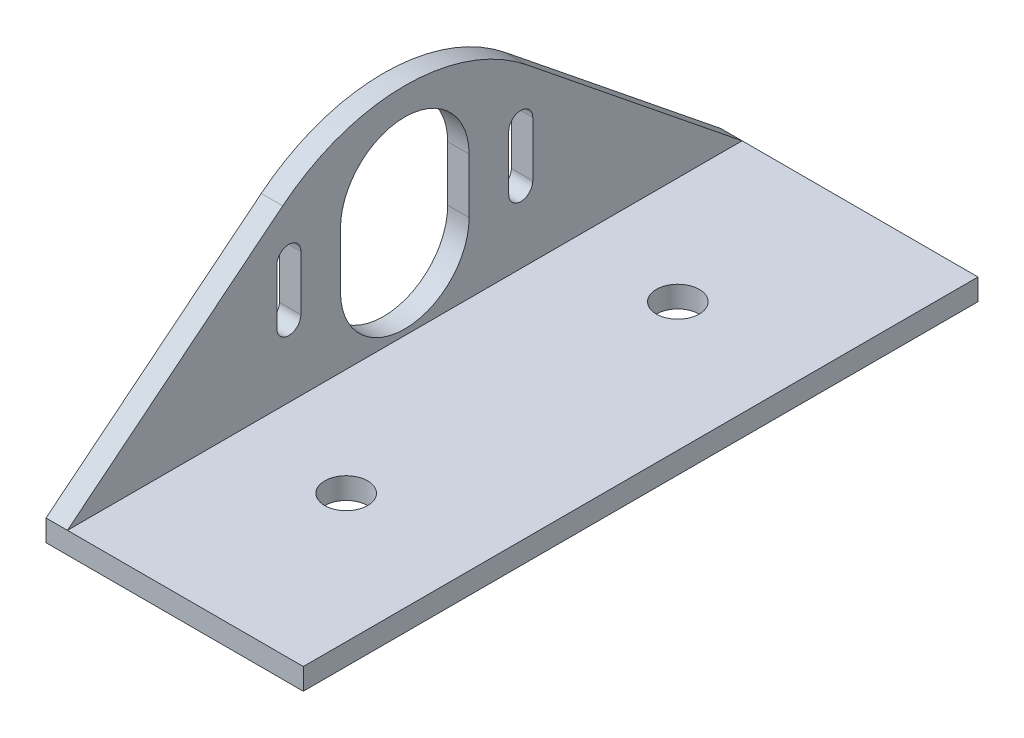
ISO-10303-21;
HEADER;
FILE_DESCRIPTION(('STEP AP214'),'2;1');
FILE_NAME('part.step','',(''),(''),'','','');
FILE_SCHEMA(('AUTOMOTIVE_DESIGN { 1 0 10303 214 1 1 1 1 }'));
ENDSEC;
DATA;
#1=APPLICATION_CONTEXT('core data for automotive mechanical design processes');
#2=APPLICATION_PROTOCOL_DEFINITION('international standard','automotive_design',2000,#1);
#3=PRODUCT_CONTEXT('',#1,'mechanical');
#4=PRODUCT('Part','Part','',(#3));
#5=PRODUCT_RELATED_PRODUCT_CATEGORY('part','',(#4));
#6=PRODUCT_DEFINITION_FORMATION('','',#4);
#7=PRODUCT_DEFINITION_CONTEXT('part definition',#1,'design');
#8=PRODUCT_DEFINITION('design','',#6,#7);
#9=PRODUCT_DEFINITION_SHAPE('','',#8);
#10=(LENGTH_UNIT() NAMED_UNIT(*) SI_UNIT(.MILLI.,.METRE.));
#11=(NAMED_UNIT(*) PLANE_ANGLE_UNIT() SI_UNIT($,.RADIAN.));
#12=(NAMED_UNIT(*) SI_UNIT($,.STERADIAN.) SOLID_ANGLE_UNIT());
#13=UNCERTAINTY_MEASURE_WITH_UNIT(LENGTH_MEASURE(1.E-05),#10,'distance_accuracy_value','');
#14=(GEOMETRIC_REPRESENTATION_CONTEXT(3) GLOBAL_UNCERTAINTY_ASSIGNED_CONTEXT((#13)) GLOBAL_UNIT_ASSIGNED_CONTEXT((#10,
#11,#12)) REPRESENTATION_CONTEXT('',''));
#15=CARTESIAN_POINT('',(0.,0.,0.));
#16=DIRECTION('',(0.,0.,1.));
#17=DIRECTION('',(1.,0.,0.));
#18=AXIS2_PLACEMENT_3D('',#15,#16,#17);
#19=CARTESIAN_POINT('',(0.,3.175,0.));
#20=DIRECTION('',(0.,1.,0.));
#21=DIRECTION('',(0.,0.,1.));
#22=AXIS2_PLACEMENT_3D('',#19,#20,#21);
#23=PLANE('',#22);
#24=DIRECTION('',(0.,0.,1.));
#25=VECTOR('',#24,1.);
#26=CARTESIAN_POINT('',(19.05,3.175,172.72));
#27=LINE('',#26,#25);
#28=CARTESIAN_POINT('',(19.05,3.175,72.8133333333333));
#29=VERTEX_POINT('',#28);
#30=CARTESIAN_POINT('',(19.05,3.175,172.72));
#31=VERTEX_POINT('',#30);
#32=EDGE_CURVE('E266',#29,#31,#27,.T.);
#33=ORIENTED_EDGE('',*,*,#32,.F.);
#34=DIRECTION('',(-1.,0.,0.));
#35=VECTOR('',#34,1.);
#36=CARTESIAN_POINT('',(-15.875,3.175,72.8133333333333));
#37=LINE('',#36,#35);
#38=CARTESIAN_POINT('',(-15.875,3.175,72.8133333333333));
#39=VERTEX_POINT('',#38);
#40=EDGE_CURVE('E311',#29,#39,#37,.T.);
#41=ORIENTED_EDGE('',*,*,#40,.T.);
#42=DIRECTION('',(0.,0.,-1.));
#43=VECTOR('',#42,1.);
#44=CARTESIAN_POINT('',(-15.875,3.175,63.5));
#45=LINE('',#44,#43);
#46=CARTESIAN_POINT('',(-15.875,3.175,172.72));
#47=VERTEX_POINT('',#46);
#48=EDGE_CURVE('E314',#47,#39,#45,.T.);
#49=ORIENTED_EDGE('',*,*,#48,.F.);
#50=DIRECTION('',(-1.,0.,0.));
#51=VECTOR('',#50,1.);
#52=CARTESIAN_POINT('',(38.1,3.175,172.72));
#53=LINE('',#52,#51);
#54=EDGE_CURVE('E12',#31,#47,#53,.T.);
#55=ORIENTED_EDGE('',*,*,#54,.F.);
#56=EDGE_LOOP('',(#33,#41,#49,#55));
#57=FACE_BOUND('',#56,.T.);
#58=CARTESIAN_POINT('',(0.,3.175,98.2133333333333));
#59=DIRECTION('',(0.,1.,0.));
#60=DIRECTION('',(0.,0.,1.));
#61=AXIS2_PLACEMENT_3D('',#58,#59,#60);
#62=CIRCLE('',#61,3.17499999999999);
#63=CARTESIAN_POINT('',(0.,3.175,101.388333333333));
#64=VERTEX_POINT('',#63);
#65=EDGE_CURVE('E322',#64,#64,#62,.T.);
#66=ORIENTED_EDGE('',*,*,#65,.F.);
#67=EDGE_LOOP('',(#66));
#68=FACE_BOUND('',#67,.T.);
#69=CARTESIAN_POINT('',(0.,3.175,147.32));
#70=DIRECTION('',(0.,1.,0.));
#71=DIRECTION('',(0.,0.,1.));
#72=AXIS2_PLACEMENT_3D('',#69,#70,#71);
#73=CIRCLE('',#72,3.175);
#74=CARTESIAN_POINT('',(0.,3.175,150.495));
#75=VERTEX_POINT('',#74);
#76=EDGE_CURVE('E318',#75,#75,#73,.T.);
#77=ORIENTED_EDGE('',*,*,#76,.F.);
#78=EDGE_LOOP('',(#77));
#79=FACE_BOUND('',#78,.T.);
#80=ADVANCED_FACE('F34',(#57,#68,#79),#23,.T.);
#81=CARTESIAN_POINT('',(0.,0.,0.));
#82=DIRECTION('',(0.,1.,0.));
#83=DIRECTION('',(0.,0.,1.));
#84=AXIS2_PLACEMENT_3D('',#81,#82,#83);
#85=PLANE('',#84);
#86=CARTESIAN_POINT('',(0.,0.,147.32));
#87=DIRECTION('',(0.,1.,0.));
#88=DIRECTION('',(0.,0.,1.));
#89=AXIS2_PLACEMENT_3D('',#86,#87,#88);
#90=CIRCLE('',#89,3.175);
#91=CARTESIAN_POINT('',(0.,0.,150.495));
#92=VERTEX_POINT('',#91);
#93=EDGE_CURVE('E325',#92,#92,#90,.T.);
#94=ORIENTED_EDGE('',*,*,#93,.T.);
#95=EDGE_LOOP('',(#94));
#96=FACE_BOUND('',#95,.T.);
#97=CARTESIAN_POINT('',(0.,0.,98.2133333333333));
#98=DIRECTION('',(0.,1.,0.));
#99=DIRECTION('',(0.,0.,1.));
#100=AXIS2_PLACEMENT_3D('',#97,#98,#99);
#101=CIRCLE('',#100,3.17499999999999);
#102=CARTESIAN_POINT('',(0.,0.,101.388333333333));
#103=VERTEX_POINT('',#102);
#104=EDGE_CURVE('E319',#103,#103,#101,.T.);
#105=ORIENTED_EDGE('',*,*,#104,.T.);
#106=EDGE_LOOP('',(#105));
#107=FACE_BOUND('',#106,.T.);
#108=DIRECTION('',(-1.,0.,0.));
#109=VECTOR('',#108,1.);
#110=CARTESIAN_POINT('',(-15.875,0.,72.8133333333333));
#111=LINE('',#110,#109);
#112=CARTESIAN_POINT('',(19.05,0.,72.8133333333333));
#113=VERTEX_POINT('',#112);
#114=CARTESIAN_POINT('',(-19.05,0.,72.8133333333333));
#115=VERTEX_POINT('',#114);
#116=EDGE_CURVE('E312',#113,#115,#111,.T.);
#117=ORIENTED_EDGE('',*,*,#116,.F.);
#118=DIRECTION('',(0.,0.,1.));
#119=VECTOR('',#118,1.);
#120=CARTESIAN_POINT('',(19.05,0.,172.72));
#121=LINE('',#120,#119);
#122=CARTESIAN_POINT('',(19.05,0.,172.72));
#123=VERTEX_POINT('',#122);
#124=EDGE_CURVE('E267',#113,#123,#121,.T.);
#125=ORIENTED_EDGE('',*,*,#124,.T.);
#126=DIRECTION('',(1.,0.,0.));
#127=VECTOR('',#126,1.);
#128=CARTESIAN_POINT('',(38.1,0.,172.72));
#129=LINE('',#128,#127);
#130=CARTESIAN_POINT('',(-19.05,0.,172.72));
#131=VERTEX_POINT('',#130);
#132=EDGE_CURVE('E42',#131,#123,#129,.T.);
#133=ORIENTED_EDGE('',*,*,#132,.F.);
#134=DIRECTION('',(0.,0.,-1.));
#135=VECTOR('',#134,1.);
#136=CARTESIAN_POINT('',(-19.05,0.,172.72));
#137=LINE('',#136,#135);
#138=EDGE_CURVE('E291',#131,#115,#137,.T.);
#139=ORIENTED_EDGE('',*,*,#138,.T.);
#140=EDGE_LOOP('',(#117,#125,#133,#139));
#141=FACE_BOUND('',#140,.T.);
#142=ADVANCED_FACE('F36',(#96,#107,#141),#85,.F.);
#143=CARTESIAN_POINT('',(0.,0.,172.72));
#144=DIRECTION('',(0.,0.,-1.));
#145=DIRECTION('',(-1.,0.,0.));
#146=AXIS2_PLACEMENT_3D('',#143,#144,#145);
#147=PLANE('',#146);
#148=ORIENTED_EDGE('',*,*,#132,.T.);
#149=DIRECTION('',(0.,1.,0.));
#150=VECTOR('',#149,1.);
#151=CARTESIAN_POINT('',(19.05,0.,172.72));
#152=LINE('',#151,#150);
#153=EDGE_CURVE('E272',#123,#31,#152,.T.);
#154=ORIENTED_EDGE('',*,*,#153,.T.);
#155=ORIENTED_EDGE('',*,*,#54,.T.);
#156=DIRECTION('',(1.,0.,0.));
#157=VECTOR('',#156,1.);
#158=CARTESIAN_POINT('',(-19.05,3.175,172.72));
#159=LINE('',#158,#157);
#160=CARTESIAN_POINT('',(-19.05,3.175,172.72));
#161=VERTEX_POINT('',#160);
#162=EDGE_CURVE('E308',#161,#47,#159,.T.);
#163=ORIENTED_EDGE('',*,*,#162,.F.);
#164=DIRECTION('',(0.,1.,0.));
#165=VECTOR('',#164,1.);
#166=CARTESIAN_POINT('',(-19.05,0.,172.72));
#167=LINE('',#166,#165);
#168=EDGE_CURVE('E277',#131,#161,#167,.T.);
#169=ORIENTED_EDGE('',*,*,#168,.F.);
#170=EDGE_LOOP('',(#148,#154,#155,#163,#169));
#171=FACE_BOUND('',#170,.T.);
#172=ADVANCED_FACE('F332',(#171),#147,.F.);
#173=CARTESIAN_POINT('',(0.,0.,147.32));
#174=DIRECTION('',(0.,1.,0.));
#175=DIRECTION('',(0.,0.,1.));
#176=AXIS2_PLACEMENT_3D('',#173,#174,#175);
#177=CYLINDRICAL_SURFACE('',#176,3.175);
#178=ORIENTED_EDGE('',*,*,#93,.F.);
#179=EDGE_LOOP('',(#178));
#180=FACE_BOUND('',#179,.T.);
#181=ORIENTED_EDGE('',*,*,#76,.T.);
#182=EDGE_LOOP('',(#181));
#183=FACE_BOUND('',#182,.T.);
#184=ADVANCED_FACE('F381',(#180,#183),#177,.F.);
#185=CARTESIAN_POINT('',(0.,0.,98.2133333333333));
#186=DIRECTION('',(0.,1.,0.));
#187=DIRECTION('',(0.,0.,1.));
#188=AXIS2_PLACEMENT_3D('',#185,#186,#187);
#189=CYLINDRICAL_SURFACE('',#188,3.17499999999999);
#190=ORIENTED_EDGE('',*,*,#104,.F.);
#191=EDGE_LOOP('',(#190));
#192=FACE_BOUND('',#191,.T.);
#193=ORIENTED_EDGE('',*,*,#65,.T.);
#194=EDGE_LOOP('',(#193));
#195=FACE_BOUND('',#194,.T.);
#196=ADVANCED_FACE('F384',(#192,#195),#189,.F.);
#197=CARTESIAN_POINT('',(-15.875,0.,72.8133333333333));
#198=DIRECTION('',(0.,0.,-1.));
#199=DIRECTION('',(-1.,0.,0.));
#200=AXIS2_PLACEMENT_3D('',#197,#198,#199);
#201=PLANE('',#200);
#202=DIRECTION('',(0.,1.,0.));
#203=VECTOR('',#202,1.);
#204=CARTESIAN_POINT('',(19.05,0.,72.8133333333333));
#205=LINE('',#204,#203);
#206=EDGE_CURVE('E270',#113,#29,#205,.T.);
#207=ORIENTED_EDGE('',*,*,#206,.F.);
#208=ORIENTED_EDGE('',*,*,#116,.T.);
#209=DIRECTION('',(0.,1.,0.));
#210=VECTOR('',#209,1.);
#211=CARTESIAN_POINT('',(-19.05,0.,72.8133333333333));
#212=LINE('',#211,#210);
#213=CARTESIAN_POINT('',(-19.05,3.175,72.8133333333333));
#214=VERTEX_POINT('',#213);
#215=EDGE_CURVE('E288',#115,#214,#212,.T.);
#216=ORIENTED_EDGE('',*,*,#215,.T.);
#217=DIRECTION('',(1.,0.,0.));
#218=VECTOR('',#217,1.);
#219=CARTESIAN_POINT('',(-19.05,3.175,72.8133333333333));
#220=LINE('',#219,#218);
#221=EDGE_CURVE('E294',#214,#39,#220,.T.);
#222=ORIENTED_EDGE('',*,*,#221,.T.);
#223=ORIENTED_EDGE('',*,*,#40,.F.);
#224=EDGE_LOOP('',(#207,#208,#216,#222,#223));
#225=FACE_BOUND('',#224,.T.);
#226=ADVANCED_FACE('F344',(#225),#201,.T.);
#227=CARTESIAN_POINT('',(-15.875,6.40446834382458,122.766666666667));
#228=DIRECTION('',(-1.,0.,0.));
#229=DIRECTION('',(0.,0.,1.));
#230=AXIS2_PLACEMENT_3D('',#227,#228,#229);
#231=PLANE('',#230);
#232=DIRECTION('',(0.,1.,0.));
#233=VECTOR('',#232,1.);
#234=CARTESIAN_POINT('',(-15.875,6.40446834382458,141.716389559935));
#235=LINE('',#234,#233);
#236=CARTESIAN_POINT('',(-15.875,13.5459562161051,141.716389559935));
#237=VERTEX_POINT('',#236);
#238=CARTESIAN_POINT('',(-15.875,21.6805168486304,141.716389559935));
#239=VERTEX_POINT('',#238);
#240=EDGE_CURVE('E228',#237,#239,#235,.T.);
#241=ORIENTED_EDGE('',*,*,#240,.T.);
#242=CARTESIAN_POINT('',(-15.875,21.6805168486304,139.938389559935));
#243=DIRECTION('',(-1.,0.,0.));
#244=DIRECTION('',(0.,0.,1.));
#245=AXIS2_PLACEMENT_3D('',#242,#243,#244);
#246=CIRCLE('',#245,1.778);
#247=CARTESIAN_POINT('',(-15.875,21.6805168486304,138.160389559935));
#248=VERTEX_POINT('',#247);
#249=EDGE_CURVE('E231',#239,#248,#246,.T.);
#250=ORIENTED_EDGE('',*,*,#249,.T.);
#251=DIRECTION('',(0.,-1.,0.));
#252=VECTOR('',#251,1.);
#253=CARTESIAN_POINT('',(-15.875,6.40446834382458,138.160389559935));
#254=LINE('',#253,#252);
#255=CARTESIAN_POINT('',(-15.875,13.5459562161051,138.160389559935));
#256=VERTEX_POINT('',#255);
#257=EDGE_CURVE('E225',#248,#256,#254,.T.);
#258=ORIENTED_EDGE('',*,*,#257,.T.);
#259=CARTESIAN_POINT('',(-15.875,13.5459562161051,139.938389559935));
#260=DIRECTION('',(-1.,0.,0.));
#261=DIRECTION('',(0.,0.,1.));
#262=AXIS2_PLACEMENT_3D('',#259,#260,#261);
#263=CIRCLE('',#262,1.778);
#264=EDGE_CURVE('E169',#256,#237,#263,.T.);
#265=ORIENTED_EDGE('',*,*,#264,.T.);
#266=EDGE_LOOP('',(#241,#250,#258,#265));
#267=FACE_BOUND('',#266,.T.);
#268=DIRECTION('',(0.,1.,0.));
#269=VECTOR('',#268,1.);
#270=CARTESIAN_POINT('',(-15.875,6.40446834382458,107.372943773399));
#271=LINE('',#270,#269);
#272=CARTESIAN_POINT('',(-15.875,13.5459562161051,107.372943773399));
#273=VERTEX_POINT('',#272);
#274=CARTESIAN_POINT('',(-15.875,21.6805168486304,107.372943773399));
#275=VERTEX_POINT('',#274);
#276=EDGE_CURVE('E219',#273,#275,#271,.T.);
#277=ORIENTED_EDGE('',*,*,#276,.T.);
#278=CARTESIAN_POINT('',(-15.875,21.6805168486304,105.594943773399));
#279=DIRECTION('',(-1.,0.,0.));
#280=DIRECTION('',(0.,0.,1.));
#281=AXIS2_PLACEMENT_3D('',#278,#279,#280);
#282=CIRCLE('',#281,1.778);
#283=CARTESIAN_POINT('',(-15.875,21.6805168486304,103.816943773399));
#284=VERTEX_POINT('',#283);
#285=EDGE_CURVE('E222',#275,#284,#282,.T.);
#286=ORIENTED_EDGE('',*,*,#285,.T.);
#287=DIRECTION('',(0.,-1.,0.));
#288=VECTOR('',#287,1.);
#289=CARTESIAN_POINT('',(-15.875,6.40446834382452,103.816943773399));
#290=LINE('',#289,#288);
#291=CARTESIAN_POINT('',(-15.875,13.5459562161051,103.816943773399));
#292=VERTEX_POINT('',#291);
#293=EDGE_CURVE('E193',#284,#292,#290,.T.);
#294=ORIENTED_EDGE('',*,*,#293,.T.);
#295=CARTESIAN_POINT('',(-15.875,13.5459562161051,105.594943773399));
#296=DIRECTION('',(-1.,0.,0.));
#297=DIRECTION('',(0.,0.,1.));
#298=AXIS2_PLACEMENT_3D('',#295,#296,#297);
#299=CIRCLE('',#298,1.77799999999999);
#300=EDGE_CURVE('E216',#292,#273,#299,.T.);
#301=ORIENTED_EDGE('',*,*,#300,.T.);
#302=EDGE_LOOP('',(#277,#286,#294,#301));
#303=FACE_BOUND('',#302,.T.);
#304=DIRECTION('',(0.,1.,0.));
#305=VECTOR('',#304,1.);
#306=CARTESIAN_POINT('',(-15.875,6.40446834382458,132.291666666667));
#307=LINE('',#306,#305);
#308=CARTESIAN_POINT('',(-15.875,13.5459562161051,132.291666666667));
#309=VERTEX_POINT('',#308);
#310=CARTESIAN_POINT('',(-15.875,21.6805168486304,132.291666666667));
#311=VERTEX_POINT('',#310);
#312=EDGE_CURVE('E260',#309,#311,#307,.T.);
#313=ORIENTED_EDGE('',*,*,#312,.T.);
#314=CARTESIAN_POINT('',(-15.875,21.6805168486304,122.766666666667));
#315=DIRECTION('',(-1.,0.,0.));
#316=DIRECTION('',(0.,0.,1.));
#317=AXIS2_PLACEMENT_3D('',#314,#315,#316);
#318=CIRCLE('',#317,9.52499999999999);
#319=CARTESIAN_POINT('',(-15.875,21.6805168486304,113.241666666667));
#320=VERTEX_POINT('',#319);
#321=EDGE_CURVE('E263',#311,#320,#318,.T.);
#322=ORIENTED_EDGE('',*,*,#321,.T.);
#323=DIRECTION('',(0.,-1.,0.));
#324=VECTOR('',#323,1.);
#325=CARTESIAN_POINT('',(-15.875,6.40446834382458,113.241666666667));
#326=LINE('',#325,#324);
#327=CARTESIAN_POINT('',(-15.875,13.5459562161051,113.241666666667));
#328=VERTEX_POINT('',#327);
#329=EDGE_CURVE('E248',#320,#328,#326,.T.);
#330=ORIENTED_EDGE('',*,*,#329,.T.);
#331=CARTESIAN_POINT('',(-15.875,13.5459562161051,122.766666666667));
#332=DIRECTION('',(-1.,0.,0.));
#333=DIRECTION('',(0.,0.,1.));
#334=AXIS2_PLACEMENT_3D('',#331,#332,#333);
#335=CIRCLE('',#334,9.52499999999999);
#336=EDGE_CURVE('E257',#328,#309,#335,.T.);
#337=ORIENTED_EDGE('',*,*,#336,.T.);
#338=EDGE_LOOP('',(#313,#322,#330,#337));
#339=FACE_BOUND('',#338,.T.);
#340=DIRECTION('',(0.,0.627325053084957,-0.778757521807626));
#341=VECTOR('',#340,1.);
#342=CARTESIAN_POINT('',(-15.875,3.175,172.72));
#343=LINE('',#342,#341);
#344=CARTESIAN_POINT('',(-15.875,28.8498213138089,140.847432308227));
#345=VERTEX_POINT('',#344);
#346=EDGE_CURVE('E275',#47,#345,#343,.T.);
#347=ORIENTED_EDGE('',*,*,#346,.F.);
#348=ORIENTED_EDGE('',*,*,#48,.T.);
#349=DIRECTION('',(0.,0.627325053084957,0.778757521807626));
#350=VECTOR('',#349,1.);
#351=CARTESIAN_POINT('',(-15.875,3.175,72.8133333333333));
#352=LINE('',#351,#350);
#353=CARTESIAN_POINT('',(-15.875,28.8498213138088,104.685901025106));
#354=VERTEX_POINT('',#353);
#355=EDGE_CURVE('E281',#39,#354,#352,.T.);
#356=ORIENTED_EDGE('',*,*,#355,.T.);
#357=CARTESIAN_POINT('',(-15.875,6.40446834382458,122.766666666667));
#358=DIRECTION('',(-1.,0.,0.));
#359=DIRECTION('',(0.,0.,1.));
#360=AXIS2_PLACEMENT_3D('',#357,#358,#359);
#361=CIRCLE('',#360,28.8220047209109);
#362=EDGE_CURVE('E296',#345,#354,#361,.T.);
#363=ORIENTED_EDGE('',*,*,#362,.F.);
#364=EDGE_LOOP('',(#347,#348,#356,#363));
#365=FACE_BOUND('',#364,.T.);
#366=ADVANCED_FACE('F352',(#267,#303,#339,#365),#231,.F.);
#367=CARTESIAN_POINT('',(-19.05,3.175,172.72));
#368=DIRECTION('',(0.,-0.778757521807626,-0.627325053084957));
#369=DIRECTION('',(0.,0.627325053084957,-0.778757521807626));
#370=AXIS2_PLACEMENT_3D('',#367,#368,#369);
#371=PLANE('',#370);
#372=ORIENTED_EDGE('',*,*,#346,.T.);
#373=DIRECTION('',(1.,0.,0.));
#374=VECTOR('',#373,1.);
#375=CARTESIAN_POINT('',(-19.05,28.8498213138089,140.847432308227));
#376=LINE('',#375,#374);
#377=CARTESIAN_POINT('',(-19.05,28.8498213138089,140.847432308227));
#378=VERTEX_POINT('',#377);
#379=EDGE_CURVE('E305',#378,#345,#376,.T.);
#380=ORIENTED_EDGE('',*,*,#379,.F.);
#381=DIRECTION('',(0.,0.627325053084957,-0.778757521807626));
#382=VECTOR('',#381,1.);
#383=CARTESIAN_POINT('',(-19.05,3.175,172.72));
#384=LINE('',#383,#382);
#385=EDGE_CURVE('E280',#161,#378,#384,.T.);
#386=ORIENTED_EDGE('',*,*,#385,.F.);
#387=ORIENTED_EDGE('',*,*,#162,.T.);
#388=EDGE_LOOP('',(#372,#380,#386,#387));
#389=FACE_BOUND('',#388,.T.);
#390=ADVANCED_FACE('F356',(#389),#371,.F.);
#391=CARTESIAN_POINT('',(-19.05,6.40446834382458,122.766666666667));
#392=DIRECTION('',(1.,0.,0.));
#393=DIRECTION('',(0.,0.,-1.));
#394=AXIS2_PLACEMENT_3D('',#391,#392,#393);
#395=CYLINDRICAL_SURFACE('',#394,28.8220047209109);
#396=ORIENTED_EDGE('',*,*,#362,.T.);
#397=DIRECTION('',(1.,0.,0.));
#398=VECTOR('',#397,1.);
#399=CARTESIAN_POINT('',(-19.05,28.8498213138088,104.685901025106));
#400=LINE('',#399,#398);
#401=CARTESIAN_POINT('',(-19.05,28.8498213138088,104.685901025106));
#402=VERTEX_POINT('',#401);
#403=EDGE_CURVE('E303',#402,#354,#400,.T.);
#404=ORIENTED_EDGE('',*,*,#403,.F.);
#405=CARTESIAN_POINT('',(-19.05,6.40446834382458,122.766666666667));
#406=DIRECTION('',(-1.,0.,0.));
#407=DIRECTION('',(0.,0.,1.));
#408=AXIS2_PLACEMENT_3D('',#405,#406,#407);
#409=CIRCLE('',#408,28.8220047209109);
#410=EDGE_CURVE('E283',#378,#402,#409,.T.);
#411=ORIENTED_EDGE('',*,*,#410,.F.);
#412=ORIENTED_EDGE('',*,*,#379,.T.);
#413=EDGE_LOOP('',(#396,#404,#411,#412));
#414=FACE_BOUND('',#413,.T.);
#415=ADVANCED_FACE('F364',(#414),#395,.T.);
#416=CARTESIAN_POINT('',(-19.05,3.175,72.8133333333333));
#417=DIRECTION('',(0.,0.778757521807626,-0.627325053084957));
#418=DIRECTION('',(0.,0.627325053084957,0.778757521807626));
#419=AXIS2_PLACEMENT_3D('',#416,#417,#418);
#420=PLANE('',#419);
#421=ORIENTED_EDGE('',*,*,#355,.F.);
#422=ORIENTED_EDGE('',*,*,#221,.F.);
#423=DIRECTION('',(0.,0.627325053084957,0.778757521807626));
#424=VECTOR('',#423,1.);
#425=CARTESIAN_POINT('',(-19.05,3.175,72.8133333333333));
#426=LINE('',#425,#424);
#427=EDGE_CURVE('E285',#214,#402,#426,.T.);
#428=ORIENTED_EDGE('',*,*,#427,.T.);
#429=ORIENTED_EDGE('',*,*,#403,.T.);
#430=EDGE_LOOP('',(#421,#422,#428,#429));
#431=FACE_BOUND('',#430,.T.);
#432=ADVANCED_FACE('F362',(#431),#420,.T.);
#433=CARTESIAN_POINT('',(-19.05,6.40446834382458,122.766666666667));
#434=DIRECTION('',(-1.,0.,0.));
#435=DIRECTION('',(0.,0.,1.));
#436=AXIS2_PLACEMENT_3D('',#433,#434,#435);
#437=PLANE('',#436);
#438=CARTESIAN_POINT('',(-19.05,21.6805168486304,139.938389559935));
#439=DIRECTION('',(-1.,0.,0.));
#440=DIRECTION('',(0.,0.,1.));
#441=AXIS2_PLACEMENT_3D('',#438,#439,#440);
#442=CIRCLE('',#441,1.778);
#443=CARTESIAN_POINT('',(-19.05,21.6805168486304,141.716389559935));
#444=VERTEX_POINT('',#443);
#445=CARTESIAN_POINT('',(-19.05,21.6805168486304,138.160389559935));
#446=VERTEX_POINT('',#445);
#447=EDGE_CURVE('E181',#444,#446,#442,.T.);
#448=ORIENTED_EDGE('',*,*,#447,.F.);
#449=DIRECTION('',(0.,1.,0.));
#450=VECTOR('',#449,1.);
#451=CARTESIAN_POINT('',(-19.05,21.6805168486304,141.716389559935));
#452=LINE('',#451,#450);
#453=CARTESIAN_POINT('',(-19.05,13.5459562161051,141.716389559935));
#454=VERTEX_POINT('',#453);
#455=EDGE_CURVE('E186',#454,#444,#452,.T.);
#456=ORIENTED_EDGE('',*,*,#455,.F.);
#457=CARTESIAN_POINT('',(-19.05,13.5459562161051,139.938389559935));
#458=DIRECTION('',(-1.,0.,0.));
#459=DIRECTION('',(0.,0.,1.));
#460=AXIS2_PLACEMENT_3D('',#457,#458,#459);
#461=CIRCLE('',#460,1.778);
#462=CARTESIAN_POINT('',(-19.05,13.5459562161051,138.160389559935));
#463=VERTEX_POINT('',#462);
#464=EDGE_CURVE('E166',#463,#454,#461,.T.);
#465=ORIENTED_EDGE('',*,*,#464,.F.);
#466=DIRECTION('',(0.,-1.,0.));
#467=VECTOR('',#466,1.);
#468=CARTESIAN_POINT('',(-19.05,21.6805168486304,138.160389559935));
#469=LINE('',#468,#467);
#470=EDGE_CURVE('E176',#446,#463,#469,.T.);
#471=ORIENTED_EDGE('',*,*,#470,.F.);
#472=EDGE_LOOP('',(#448,#456,#465,#471));
#473=FACE_BOUND('',#472,.T.);
#474=CARTESIAN_POINT('',(-19.05,21.6805168486304,105.594943773399));
#475=DIRECTION('',(-1.,0.,0.));
#476=DIRECTION('',(0.,0.,1.));
#477=AXIS2_PLACEMENT_3D('',#474,#475,#476);
#478=CIRCLE('',#477,1.778);
#479=CARTESIAN_POINT('',(-19.05,21.6805168486304,107.372943773399));
#480=VERTEX_POINT('',#479);
#481=CARTESIAN_POINT('',(-19.05,21.6805168486304,103.816943773399));
#482=VERTEX_POINT('',#481);
#483=EDGE_CURVE('E196',#480,#482,#478,.T.);
#484=ORIENTED_EDGE('',*,*,#483,.F.);
#485=DIRECTION('',(0.,1.,0.));
#486=VECTOR('',#485,1.);
#487=CARTESIAN_POINT('',(-19.05,21.6805168486304,107.372943773399));
#488=LINE('',#487,#486);
#489=CARTESIAN_POINT('',(-19.05,13.5459562161051,107.372943773399));
#490=VERTEX_POINT('',#489);
#491=EDGE_CURVE('E203',#490,#480,#488,.T.);
#492=ORIENTED_EDGE('',*,*,#491,.F.);
#493=CARTESIAN_POINT('',(-19.05,13.5459562161051,105.594943773399));
#494=DIRECTION('',(-1.,0.,0.));
#495=DIRECTION('',(0.,0.,1.));
#496=AXIS2_PLACEMENT_3D('',#493,#494,#495);
#497=CIRCLE('',#496,1.77799999999999);
#498=CARTESIAN_POINT('',(-19.05,13.5459562161051,103.816943773399));
#499=VERTEX_POINT('',#498);
#500=EDGE_CURVE('E200',#499,#490,#497,.T.);
#501=ORIENTED_EDGE('',*,*,#500,.F.);
#502=DIRECTION('',(0.,-1.,0.));
#503=VECTOR('',#502,1.);
#504=CARTESIAN_POINT('',(-19.05,21.6805168486304,103.816943773399));
#505=LINE('',#504,#503);
#506=EDGE_CURVE('E198',#482,#499,#505,.T.);
#507=ORIENTED_EDGE('',*,*,#506,.F.);
#508=EDGE_LOOP('',(#484,#492,#501,#507));
#509=FACE_BOUND('',#508,.T.);
#510=CARTESIAN_POINT('',(-19.05,21.6805168486304,122.766666666667));
#511=DIRECTION('',(-1.,0.,0.));
#512=DIRECTION('',(0.,0.,1.));
#513=AXIS2_PLACEMENT_3D('',#510,#511,#512);
#514=CIRCLE('',#513,9.52499999999999);
#515=CARTESIAN_POINT('',(-19.05,21.6805168486304,132.291666666667));
#516=VERTEX_POINT('',#515);
#517=CARTESIAN_POINT('',(-19.05,21.6805168486304,113.241666666667));
#518=VERTEX_POINT('',#517);
#519=EDGE_CURVE('E234',#516,#518,#514,.T.);
#520=ORIENTED_EDGE('',*,*,#519,.F.);
#521=DIRECTION('',(0.,1.,0.));
#522=VECTOR('',#521,1.);
#523=CARTESIAN_POINT('',(-19.05,21.6805168486304,132.291666666667));
#524=LINE('',#523,#522);
#525=CARTESIAN_POINT('',(-19.05,13.5459562161051,132.291666666667));
#526=VERTEX_POINT('',#525);
#527=EDGE_CURVE('E242',#526,#516,#524,.T.);
#528=ORIENTED_EDGE('',*,*,#527,.F.);
#529=CARTESIAN_POINT('',(-19.05,13.5459562161051,122.766666666667));
#530=DIRECTION('',(-1.,0.,0.));
#531=DIRECTION('',(0.,0.,1.));
#532=AXIS2_PLACEMENT_3D('',#529,#530,#531);
#533=CIRCLE('',#532,9.52499999999999);
#534=CARTESIAN_POINT('',(-19.05,13.5459562161051,113.241666666667));
#535=VERTEX_POINT('',#534);
#536=EDGE_CURVE('E239',#535,#526,#533,.T.);
#537=ORIENTED_EDGE('',*,*,#536,.F.);
#538=DIRECTION('',(0.,-1.,0.));
#539=VECTOR('',#538,1.);
#540=CARTESIAN_POINT('',(-19.05,21.6805168486304,113.241666666667));
#541=LINE('',#540,#539);
#542=EDGE_CURVE('E236',#518,#535,#541,.T.);
#543=ORIENTED_EDGE('',*,*,#542,.F.);
#544=EDGE_LOOP('',(#520,#528,#537,#543));
#545=FACE_BOUND('',#544,.T.);
#546=ORIENTED_EDGE('',*,*,#168,.T.);
#547=ORIENTED_EDGE('',*,*,#385,.T.);
#548=ORIENTED_EDGE('',*,*,#410,.T.);
#549=ORIENTED_EDGE('',*,*,#427,.F.);
#550=ORIENTED_EDGE('',*,*,#215,.F.);
#551=ORIENTED_EDGE('',*,*,#138,.F.);
#552=EDGE_LOOP('',(#546,#547,#548,#549,#550,#551));
#553=FACE_BOUND('',#552,.T.);
#554=ADVANCED_FACE('F183',(#473,#509,#545,#553),#437,.T.);
#555=CARTESIAN_POINT('',(19.05,0.,172.72));
#556=DIRECTION('',(-1.,0.,0.));
#557=DIRECTION('',(0.,0.,1.));
#558=AXIS2_PLACEMENT_3D('',#555,#556,#557);
#559=PLANE('',#558);
#560=ORIENTED_EDGE('',*,*,#32,.T.);
#561=ORIENTED_EDGE('',*,*,#153,.F.);
#562=ORIENTED_EDGE('',*,*,#124,.F.);
#563=ORIENTED_EDGE('',*,*,#206,.T.);
#564=EDGE_LOOP('',(#560,#561,#562,#563));
#565=FACE_BOUND('',#564,.T.);
#566=ADVANCED_FACE('F340',(#565),#559,.F.);
#567=CARTESIAN_POINT('',(19.05,21.6805168486304,122.766666666667));
#568=DIRECTION('',(-1.,0.,0.));
#569=DIRECTION('',(0.,0.,1.));
#570=AXIS2_PLACEMENT_3D('',#567,#568,#569);
#571=CYLINDRICAL_SURFACE('',#570,9.52499999999999);
#572=DIRECTION('',(-1.,0.,0.));
#573=VECTOR('',#572,1.);
#574=CARTESIAN_POINT('',(19.05,21.6805168486304,132.291666666667));
#575=LINE('',#574,#573);
#576=EDGE_CURVE('E246',#311,#516,#575,.T.);
#577=ORIENTED_EDGE('',*,*,#576,.T.);
#578=ORIENTED_EDGE('',*,*,#519,.T.);
#579=DIRECTION('',(-1.,0.,0.));
#580=VECTOR('',#579,1.);
#581=CARTESIAN_POINT('',(19.05,21.6805168486304,113.241666666667));
#582=LINE('',#581,#580);
#583=EDGE_CURVE('E245',#320,#518,#582,.T.);
#584=ORIENTED_EDGE('',*,*,#583,.F.);
#585=ORIENTED_EDGE('',*,*,#321,.F.);
#586=EDGE_LOOP('',(#577,#578,#584,#585));
#587=FACE_BOUND('',#586,.T.);
#588=ADVANCED_FACE('F403',(#587),#571,.F.);
#589=CARTESIAN_POINT('',(19.05,21.6805168486304,132.291666666667));
#590=DIRECTION('',(0.,0.,1.));
#591=DIRECTION('',(1.,0.,0.));
#592=AXIS2_PLACEMENT_3D('',#589,#590,#591);
#593=PLANE('',#592);
#594=DIRECTION('',(-1.,0.,0.));
#595=VECTOR('',#594,1.);
#596=CARTESIAN_POINT('',(19.05,13.5459562161051,132.291666666667));
#597=LINE('',#596,#595);
#598=EDGE_CURVE('E249',#309,#526,#597,.T.);
#599=ORIENTED_EDGE('',*,*,#598,.T.);
#600=ORIENTED_EDGE('',*,*,#527,.T.);
#601=ORIENTED_EDGE('',*,*,#576,.F.);
#602=ORIENTED_EDGE('',*,*,#312,.F.);
#603=EDGE_LOOP('',(#599,#600,#601,#602));
#604=FACE_BOUND('',#603,.T.);
#605=ADVANCED_FACE('F406',(#604),#593,.F.);
#606=CARTESIAN_POINT('',(19.05,13.5459562161051,122.766666666667));
#607=DIRECTION('',(-1.,0.,0.));
#608=DIRECTION('',(0.,0.,1.));
#609=AXIS2_PLACEMENT_3D('',#606,#607,#608);
#610=CYLINDRICAL_SURFACE('',#609,9.52499999999999);
#611=DIRECTION('',(-1.,0.,0.));
#612=VECTOR('',#611,1.);
#613=CARTESIAN_POINT('',(19.05,13.5459562161051,113.241666666667));
#614=LINE('',#613,#612);
#615=EDGE_CURVE('E251',#328,#535,#614,.T.);
#616=ORIENTED_EDGE('',*,*,#615,.T.);
#617=ORIENTED_EDGE('',*,*,#536,.T.);
#618=ORIENTED_EDGE('',*,*,#598,.F.);
#619=ORIENTED_EDGE('',*,*,#336,.F.);
#620=EDGE_LOOP('',(#616,#617,#618,#619));
#621=FACE_BOUND('',#620,.T.);
#622=ADVANCED_FACE('F412',(#621),#610,.F.);
#623=CARTESIAN_POINT('',(19.05,21.6805168486304,113.241666666667));
#624=DIRECTION('',(0.,0.,-1.));
#625=DIRECTION('',(-1.,0.,0.));
#626=AXIS2_PLACEMENT_3D('',#623,#624,#625);
#627=PLANE('',#626);
#628=ORIENTED_EDGE('',*,*,#583,.T.);
#629=ORIENTED_EDGE('',*,*,#542,.T.);
#630=ORIENTED_EDGE('',*,*,#615,.F.);
#631=ORIENTED_EDGE('',*,*,#329,.F.);
#632=EDGE_LOOP('',(#628,#629,#630,#631));
#633=FACE_BOUND('',#632,.T.);
#634=ADVANCED_FACE('F408',(#633),#627,.F.);
#635=CARTESIAN_POINT('',(19.05,21.6805168486304,105.594943773399));
#636=DIRECTION('',(-1.,0.,0.));
#637=DIRECTION('',(0.,0.,1.));
#638=AXIS2_PLACEMENT_3D('',#635,#636,#637);
#639=CYLINDRICAL_SURFACE('',#638,1.778);
#640=DIRECTION('',(-1.,0.,0.));
#641=VECTOR('',#640,1.);
#642=CARTESIAN_POINT('',(19.05,21.6805168486304,107.372943773399));
#643=LINE('',#642,#641);
#644=EDGE_CURVE('E207',#275,#480,#643,.T.);
#645=ORIENTED_EDGE('',*,*,#644,.T.);
#646=ORIENTED_EDGE('',*,*,#483,.T.);
#647=DIRECTION('',(-1.,0.,0.));
#648=VECTOR('',#647,1.);
#649=CARTESIAN_POINT('',(19.05,21.6805168486304,103.816943773399));
#650=LINE('',#649,#648);
#651=EDGE_CURVE('E206',#284,#482,#650,.T.);
#652=ORIENTED_EDGE('',*,*,#651,.F.);
#653=ORIENTED_EDGE('',*,*,#285,.F.);
#654=EDGE_LOOP('',(#645,#646,#652,#653));
#655=FACE_BOUND('',#654,.T.);
#656=ADVANCED_FACE('F411',(#655),#639,.F.);
#657=CARTESIAN_POINT('',(19.05,21.6805168486304,107.372943773399));
#658=DIRECTION('',(0.,0.,1.));
#659=DIRECTION('',(1.,0.,0.));
#660=AXIS2_PLACEMENT_3D('',#657,#658,#659);
#661=PLANE('',#660);
#662=DIRECTION('',(-1.,0.,0.));
#663=VECTOR('',#662,1.);
#664=CARTESIAN_POINT('',(19.05,13.5459562161051,107.372943773399));
#665=LINE('',#664,#663);
#666=EDGE_CURVE('E209',#273,#490,#665,.T.);
#667=ORIENTED_EDGE('',*,*,#666,.T.);
#668=ORIENTED_EDGE('',*,*,#491,.T.);
#669=ORIENTED_EDGE('',*,*,#644,.F.);
#670=ORIENTED_EDGE('',*,*,#276,.F.);
#671=EDGE_LOOP('',(#667,#668,#669,#670));
#672=FACE_BOUND('',#671,.T.);
#673=ADVANCED_FACE('F422',(#672),#661,.F.);
#674=CARTESIAN_POINT('',(19.05,13.5459562161051,105.594943773399));
#675=DIRECTION('',(-1.,0.,0.));
#676=DIRECTION('',(0.,0.,1.));
#677=AXIS2_PLACEMENT_3D('',#674,#675,#676);
#678=CYLINDRICAL_SURFACE('',#677,1.77799999999999);
#679=DIRECTION('',(-1.,0.,0.));
#680=VECTOR('',#679,1.);
#681=CARTESIAN_POINT('',(19.05,13.5459562161051,103.816943773399));
#682=LINE('',#681,#680);
#683=EDGE_CURVE('E57',#292,#499,#682,.T.);
#684=ORIENTED_EDGE('',*,*,#683,.T.);
#685=ORIENTED_EDGE('',*,*,#500,.T.);
#686=ORIENTED_EDGE('',*,*,#666,.F.);
#687=ORIENTED_EDGE('',*,*,#300,.F.);
#688=EDGE_LOOP('',(#684,#685,#686,#687));
#689=FACE_BOUND('',#688,.T.);
#690=ADVANCED_FACE('F428',(#689),#678,.F.);
#691=CARTESIAN_POINT('',(19.05,21.6805168486304,103.816943773399));
#692=DIRECTION('',(0.,0.,-1.));
#693=DIRECTION('',(0.,1.,0.));
#694=AXIS2_PLACEMENT_3D('',#691,#692,#693);
#695=PLANE('',#694);
#696=ORIENTED_EDGE('',*,*,#651,.T.);
#697=ORIENTED_EDGE('',*,*,#506,.T.);
#698=ORIENTED_EDGE('',*,*,#683,.F.);
#699=ORIENTED_EDGE('',*,*,#293,.F.);
#700=EDGE_LOOP('',(#696,#697,#698,#699));
#701=FACE_BOUND('',#700,.T.);
#702=ADVANCED_FACE('F424',(#701),#695,.F.);
#703=CARTESIAN_POINT('',(19.05,21.6805168486304,139.938389559935));
#704=DIRECTION('',(-1.,0.,0.));
#705=DIRECTION('',(0.,0.,1.));
#706=AXIS2_PLACEMENT_3D('',#703,#704,#705);
#707=CYLINDRICAL_SURFACE('',#706,1.778);
#708=DIRECTION('',(-1.,0.,0.));
#709=VECTOR('',#708,1.);
#710=CARTESIAN_POINT('',(19.05,21.6805168486304,141.716389559935));
#711=LINE('',#710,#709);
#712=EDGE_CURVE('E191',#239,#444,#711,.T.);
#713=ORIENTED_EDGE('',*,*,#712,.T.);
#714=ORIENTED_EDGE('',*,*,#447,.T.);
#715=DIRECTION('',(-1.,0.,0.));
#716=VECTOR('',#715,1.);
#717=CARTESIAN_POINT('',(19.05,21.6805168486304,138.160389559935));
#718=LINE('',#717,#716);
#719=EDGE_CURVE('E172',#248,#446,#718,.T.);
#720=ORIENTED_EDGE('',*,*,#719,.F.);
#721=ORIENTED_EDGE('',*,*,#249,.F.);
#722=EDGE_LOOP('',(#713,#714,#720,#721));
#723=FACE_BOUND('',#722,.T.);
#724=ADVANCED_FACE('F427',(#723),#707,.F.);
#725=CARTESIAN_POINT('',(19.05,21.6805168486304,141.716389559935));
#726=DIRECTION('',(0.,0.,1.));
#727=DIRECTION('',(1.,0.,0.));
#728=AXIS2_PLACEMENT_3D('',#725,#726,#727);
#729=PLANE('',#728);
#730=DIRECTION('',(-1.,0.,0.));
#731=VECTOR('',#730,1.);
#732=CARTESIAN_POINT('',(19.05,13.5459562161051,141.716389559935));
#733=LINE('',#732,#731);
#734=EDGE_CURVE('E171',#237,#454,#733,.T.);
#735=ORIENTED_EDGE('',*,*,#734,.T.);
#736=ORIENTED_EDGE('',*,*,#455,.T.);
#737=ORIENTED_EDGE('',*,*,#712,.F.);
#738=ORIENTED_EDGE('',*,*,#240,.F.);
#739=EDGE_LOOP('',(#735,#736,#737,#738));
#740=FACE_BOUND('',#739,.T.);
#741=ADVANCED_FACE('F437',(#740),#729,.F.);
#742=CARTESIAN_POINT('',(19.05,13.5459562161051,139.938389559935));
#743=DIRECTION('',(-1.,0.,0.));
#744=DIRECTION('',(0.,0.,1.));
#745=AXIS2_PLACEMENT_3D('',#742,#743,#744);
#746=CYLINDRICAL_SURFACE('',#745,1.778);
#747=DIRECTION('',(-1.,0.,0.));
#748=VECTOR('',#747,1.);
#749=CARTESIAN_POINT('',(19.05,13.5459562161051,138.160389559935));
#750=LINE('',#749,#748);
#751=EDGE_CURVE('E49',#256,#463,#750,.T.);
#752=ORIENTED_EDGE('',*,*,#751,.T.);
#753=ORIENTED_EDGE('',*,*,#464,.T.);
#754=ORIENTED_EDGE('',*,*,#734,.F.);
#755=ORIENTED_EDGE('',*,*,#264,.F.);
#756=EDGE_LOOP('',(#752,#753,#754,#755));
#757=FACE_BOUND('',#756,.T.);
#758=ADVANCED_FACE('F163',(#757),#746,.F.);
#759=CARTESIAN_POINT('',(19.05,21.6805168486304,138.160389559935));
#760=DIRECTION('',(0.,0.,-1.));
#761=DIRECTION('',(-1.,0.,0.));
#762=AXIS2_PLACEMENT_3D('',#759,#760,#761);
#763=PLANE('',#762);
#764=ORIENTED_EDGE('',*,*,#719,.T.);
#765=ORIENTED_EDGE('',*,*,#470,.T.);
#766=ORIENTED_EDGE('',*,*,#751,.F.);
#767=ORIENTED_EDGE('',*,*,#257,.F.);
#768=EDGE_LOOP('',(#764,#765,#766,#767));
#769=FACE_BOUND('',#768,.T.);
#770=ADVANCED_FACE('F177',(#769),#763,.F.);
#771=CLOSED_SHELL('',(#80,#142,#172,#184,#196,#226,#366,#390,#415,#432,#554,#566,#588,#605,#622,
#634,#656,#673,#690,#702,#724,#741,#758,#770));
#772=MANIFOLD_SOLID_BREP('B2',#771);
#773=ADVANCED_BREP_SHAPE_REPRESENTATION('',(#18,#772),#14);
#774=SHAPE_DEFINITION_REPRESENTATION(#9,#773);
ENDSEC;
END-ISO-10303-21;
